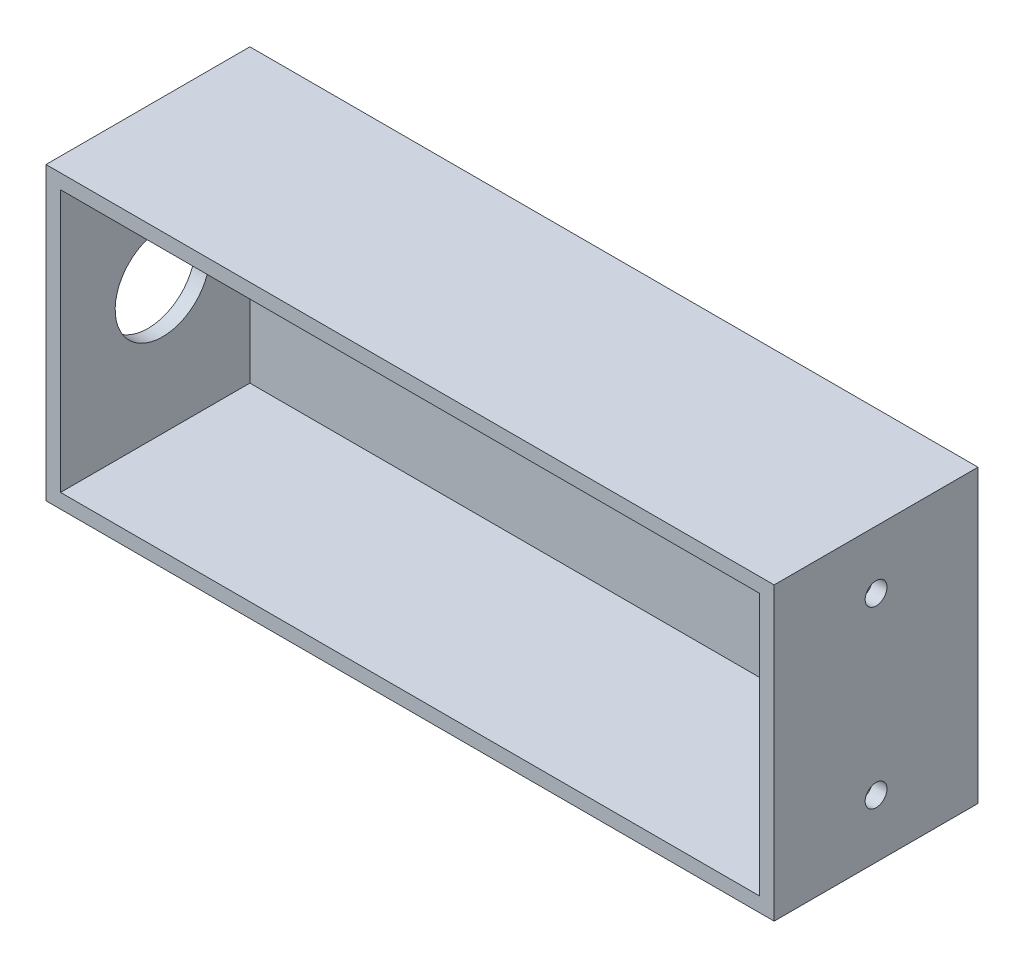
ISO-10303-21;
HEADER;
FILE_DESCRIPTION(('STEP AP214'),'2;1');
FILE_NAME('part.step','',(''),(''),'','','');
FILE_SCHEMA(('AUTOMOTIVE_DESIGN { 1 0 10303 214 1 1 1 1 }'));
ENDSEC;
DATA;
#1=APPLICATION_CONTEXT('core data for automotive mechanical design processes');
#2=APPLICATION_PROTOCOL_DEFINITION('international standard','automotive_design',2000,#1);
#3=PRODUCT_CONTEXT('',#1,'mechanical');
#4=PRODUCT('Part','Part','',(#3));
#5=PRODUCT_RELATED_PRODUCT_CATEGORY('part','',(#4));
#6=PRODUCT_DEFINITION_FORMATION('','',#4);
#7=PRODUCT_DEFINITION_CONTEXT('part definition',#1,'design');
#8=PRODUCT_DEFINITION('design','',#6,#7);
#9=PRODUCT_DEFINITION_SHAPE('','',#8);
#10=(LENGTH_UNIT() NAMED_UNIT(*) SI_UNIT(.MILLI.,.METRE.));
#11=(NAMED_UNIT(*) PLANE_ANGLE_UNIT() SI_UNIT($,.RADIAN.));
#12=(NAMED_UNIT(*) SI_UNIT($,.STERADIAN.) SOLID_ANGLE_UNIT());
#13=UNCERTAINTY_MEASURE_WITH_UNIT(LENGTH_MEASURE(1.E-05),#10,'distance_accuracy_value','');
#14=(GEOMETRIC_REPRESENTATION_CONTEXT(3) GLOBAL_UNCERTAINTY_ASSIGNED_CONTEXT((#13)) GLOBAL_UNIT_ASSIGNED_CONTEXT((#10,
#11,#12)) REPRESENTATION_CONTEXT('',''));
#15=CARTESIAN_POINT('',(0.,0.,0.));
#16=DIRECTION('',(0.,0.,1.));
#17=DIRECTION('',(1.,0.,0.));
#18=AXIS2_PLACEMENT_3D('',#15,#16,#17);
#19=CARTESIAN_POINT('',(100.,40.,56.));
#20=DIRECTION('',(-1.,0.,0.));
#21=DIRECTION('',(0.,-1.,0.));
#22=AXIS2_PLACEMENT_3D('',#19,#20,#21);
#23=PLANE('',#22);
#24=CARTESIAN_POINT('',(100.,-24.,28.));
#25=DIRECTION('',(1.,0.,0.));
#26=DIRECTION('',(0.,1.,0.));
#27=AXIS2_PLACEMENT_3D('',#24,#25,#26);
#28=CIRCLE('',#27,3.);
#29=CARTESIAN_POINT('',(100.,-21.,28.));
#30=VERTEX_POINT('',#29);
#31=EDGE_CURVE('E182',#30,#30,#28,.T.);
#32=ORIENTED_EDGE('',*,*,#31,.F.);
#33=EDGE_LOOP('',(#32));
#34=FACE_BOUND('',#33,.T.);
#35=CARTESIAN_POINT('',(100.,24.,28.));
#36=DIRECTION('',(1.,0.,0.));
#37=DIRECTION('',(0.,1.,0.));
#38=AXIS2_PLACEMENT_3D('',#35,#36,#37);
#39=CIRCLE('',#38,3.);
#40=CARTESIAN_POINT('',(100.,27.,28.));
#41=VERTEX_POINT('',#40);
#42=EDGE_CURVE('E173',#41,#41,#39,.T.);
#43=ORIENTED_EDGE('',*,*,#42,.F.);
#44=EDGE_LOOP('',(#43));
#45=FACE_BOUND('',#44,.T.);
#46=DIRECTION('',(0.,1.,0.));
#47=VECTOR('',#46,1.);
#48=CARTESIAN_POINT('',(100.,40.,0.));
#49=LINE('',#48,#47);
#50=CARTESIAN_POINT('',(100.,-40.,0.));
#51=VERTEX_POINT('',#50);
#52=CARTESIAN_POINT('',(100.,40.,0.));
#53=VERTEX_POINT('',#52);
#54=EDGE_CURVE('E148',#51,#53,#49,.T.);
#55=ORIENTED_EDGE('',*,*,#54,.T.);
#56=DIRECTION('',(0.,0.,-1.));
#57=VECTOR('',#56,1.);
#58=CARTESIAN_POINT('',(100.,40.,56.));
#59=LINE('',#58,#57);
#60=CARTESIAN_POINT('',(100.,40.,56.));
#61=VERTEX_POINT('',#60);
#62=EDGE_CURVE('E11',#61,#53,#59,.T.);
#63=ORIENTED_EDGE('',*,*,#62,.F.);
#64=DIRECTION('',(0.,1.,0.));
#65=VECTOR('',#64,1.);
#66=CARTESIAN_POINT('',(100.,40.,56.));
#67=LINE('',#66,#65);
#68=CARTESIAN_POINT('',(100.,-40.,56.));
#69=VERTEX_POINT('',#68);
#70=EDGE_CURVE('E152',#69,#61,#67,.T.);
#71=ORIENTED_EDGE('',*,*,#70,.F.);
#72=DIRECTION('',(0.,0.,-1.));
#73=VECTOR('',#72,1.);
#74=CARTESIAN_POINT('',(100.,-40.,56.));
#75=LINE('',#74,#73);
#76=EDGE_CURVE('E158',#69,#51,#75,.T.);
#77=ORIENTED_EDGE('',*,*,#76,.T.);
#78=EDGE_LOOP('',(#55,#63,#71,#77));
#79=FACE_BOUND('',#78,.T.);
#80=ADVANCED_FACE('F35',(#34,#45,#79),#23,.F.);
#81=CARTESIAN_POINT('',(-100.,40.,56.));
#82=DIRECTION('',(0.,-1.,0.));
#83=DIRECTION('',(0.,0.,-1.));
#84=AXIS2_PLACEMENT_3D('',#81,#82,#83);
#85=PLANE('',#84);
#86=DIRECTION('',(-1.,0.,0.));
#87=VECTOR('',#86,1.);
#88=CARTESIAN_POINT('',(-100.,40.,0.));
#89=LINE('',#88,#87);
#90=CARTESIAN_POINT('',(-100.,40.,0.));
#91=VERTEX_POINT('',#90);
#92=EDGE_CURVE('E161',#53,#91,#89,.T.);
#93=ORIENTED_EDGE('',*,*,#92,.T.);
#94=DIRECTION('',(0.,0.,-1.));
#95=VECTOR('',#94,1.);
#96=CARTESIAN_POINT('',(-100.,40.,56.));
#97=LINE('',#96,#95);
#98=CARTESIAN_POINT('',(-100.,40.,56.));
#99=VERTEX_POINT('',#98);
#100=EDGE_CURVE('E43',#99,#91,#97,.T.);
#101=ORIENTED_EDGE('',*,*,#100,.F.);
#102=DIRECTION('',(-1.,0.,0.));
#103=VECTOR('',#102,1.);
#104=CARTESIAN_POINT('',(-100.,40.,56.));
#105=LINE('',#104,#103);
#106=EDGE_CURVE('E88',#61,#99,#105,.T.);
#107=ORIENTED_EDGE('',*,*,#106,.F.);
#108=ORIENTED_EDGE('',*,*,#62,.T.);
#109=EDGE_LOOP('',(#93,#101,#107,#108));
#110=FACE_BOUND('',#109,.T.);
#111=ADVANCED_FACE('F192',(#110),#85,.F.);
#112=CARTESIAN_POINT('',(-100.,40.,56.));
#113=DIRECTION('',(1.,0.,0.));
#114=DIRECTION('',(0.,1.,0.));
#115=AXIS2_PLACEMENT_3D('',#112,#113,#114);
#116=PLANE('',#115);
#117=CARTESIAN_POINT('',(-100.,0.,28.));
#118=DIRECTION('',(-1.,0.,0.));
#119=DIRECTION('',(0.,-1.,0.));
#120=AXIS2_PLACEMENT_3D('',#117,#118,#119);
#121=CIRCLE('',#120,13.);
#122=CARTESIAN_POINT('',(-100.,-13.,28.));
#123=VERTEX_POINT('',#122);
#124=EDGE_CURVE('E172',#123,#123,#121,.T.);
#125=ORIENTED_EDGE('',*,*,#124,.F.);
#126=EDGE_LOOP('',(#125));
#127=FACE_BOUND('',#126,.T.);
#128=DIRECTION('',(0.,-1.,0.));
#129=VECTOR('',#128,1.);
#130=CARTESIAN_POINT('',(-100.,40.,0.));
#131=LINE('',#130,#129);
#132=CARTESIAN_POINT('',(-99.9999999999999,-40.,0.));
#133=VERTEX_POINT('',#132);
#134=EDGE_CURVE('E163',#91,#133,#131,.T.);
#135=ORIENTED_EDGE('',*,*,#134,.T.);
#136=DIRECTION('',(0.,0.,-1.));
#137=VECTOR('',#136,1.);
#138=CARTESIAN_POINT('',(-99.9999999999999,-40.,56.));
#139=LINE('',#138,#137);
#140=CARTESIAN_POINT('',(-99.9999999999999,-40.,56.));
#141=VERTEX_POINT('',#140);
#142=EDGE_CURVE('E167',#141,#133,#139,.T.);
#143=ORIENTED_EDGE('',*,*,#142,.F.);
#144=DIRECTION('',(0.,-1.,0.));
#145=VECTOR('',#144,1.);
#146=CARTESIAN_POINT('',(-100.,40.,56.));
#147=LINE('',#146,#145);
#148=EDGE_CURVE('E155',#99,#141,#147,.T.);
#149=ORIENTED_EDGE('',*,*,#148,.F.);
#150=ORIENTED_EDGE('',*,*,#100,.T.);
#151=EDGE_LOOP('',(#135,#143,#149,#150));
#152=FACE_BOUND('',#151,.T.);
#153=ADVANCED_FACE('F201',(#127,#152),#116,.F.);
#154=CARTESIAN_POINT('',(-99.9999999999999,-40.,56.));
#155=DIRECTION('',(0.,1.,0.));
#156=DIRECTION('',(0.,0.,1.));
#157=AXIS2_PLACEMENT_3D('',#154,#155,#156);
#158=PLANE('',#157);
#159=DIRECTION('',(1.,0.,0.));
#160=VECTOR('',#159,1.);
#161=CARTESIAN_POINT('',(-99.9999999999999,-40.,0.));
#162=LINE('',#161,#160);
#163=EDGE_CURVE('E81',#133,#51,#162,.T.);
#164=ORIENTED_EDGE('',*,*,#163,.T.);
#165=ORIENTED_EDGE('',*,*,#76,.F.);
#166=DIRECTION('',(1.,0.,0.));
#167=VECTOR('',#166,1.);
#168=CARTESIAN_POINT('',(-99.9999999999999,-40.,56.));
#169=LINE('',#168,#167);
#170=EDGE_CURVE('E60',#141,#69,#169,.T.);
#171=ORIENTED_EDGE('',*,*,#170,.F.);
#172=ORIENTED_EDGE('',*,*,#142,.T.);
#173=EDGE_LOOP('',(#164,#165,#171,#172));
#174=FACE_BOUND('',#173,.T.);
#175=ADVANCED_FACE('F207',(#174),#158,.F.);
#176=CARTESIAN_POINT('',(0.,0.,56.));
#177=DIRECTION('',(0.,0.,1.));
#178=DIRECTION('',(1.,0.,0.));
#179=AXIS2_PLACEMENT_3D('',#176,#177,#178);
#180=PLANE('',#179);
#181=DIRECTION('',(0.,1.,0.));
#182=VECTOR('',#181,1.);
#183=CARTESIAN_POINT('',(96.,36.,56.));
#184=LINE('',#183,#182);
#185=CARTESIAN_POINT('',(96.,-36.,56.));
#186=VERTEX_POINT('',#185);
#187=CARTESIAN_POINT('',(96.,36.,56.));
#188=VERTEX_POINT('',#187);
#189=EDGE_CURVE('E51',#186,#188,#184,.T.);
#190=ORIENTED_EDGE('',*,*,#189,.F.);
#191=DIRECTION('',(1.,0.,0.));
#192=VECTOR('',#191,1.);
#193=CARTESIAN_POINT('',(-96.,-36.,56.));
#194=LINE('',#193,#192);
#195=CARTESIAN_POINT('',(-96.,-36.,56.));
#196=VERTEX_POINT('',#195);
#197=EDGE_CURVE('E130',#196,#186,#194,.T.);
#198=ORIENTED_EDGE('',*,*,#197,.F.);
#199=DIRECTION('',(0.,-1.,0.));
#200=VECTOR('',#199,1.);
#201=CARTESIAN_POINT('',(-96.,36.,56.));
#202=LINE('',#201,#200);
#203=CARTESIAN_POINT('',(-96.,36.,56.));
#204=VERTEX_POINT('',#203);
#205=EDGE_CURVE('E133',#204,#196,#202,.T.);
#206=ORIENTED_EDGE('',*,*,#205,.F.);
#207=DIRECTION('',(-1.,0.,0.));
#208=VECTOR('',#207,1.);
#209=CARTESIAN_POINT('',(-96.,36.,56.));
#210=LINE('',#209,#208);
#211=EDGE_CURVE('E142',#188,#204,#210,.T.);
#212=ORIENTED_EDGE('',*,*,#211,.F.);
#213=EDGE_LOOP('',(#190,#198,#206,#212));
#214=FACE_BOUND('',#213,.T.);
#215=ORIENTED_EDGE('',*,*,#70,.T.);
#216=ORIENTED_EDGE('',*,*,#106,.T.);
#217=ORIENTED_EDGE('',*,*,#148,.T.);
#218=ORIENTED_EDGE('',*,*,#170,.T.);
#219=EDGE_LOOP('',(#215,#216,#217,#218));
#220=FACE_BOUND('',#219,.T.);
#221=ADVANCED_FACE('F213',(#214,#220),#180,.T.);
#222=CARTESIAN_POINT('',(0.,0.,0.));
#223=DIRECTION('',(0.,0.,1.));
#224=DIRECTION('',(1.,0.,0.));
#225=AXIS2_PLACEMENT_3D('',#222,#223,#224);
#226=PLANE('',#225);
#227=ORIENTED_EDGE('',*,*,#54,.F.);
#228=ORIENTED_EDGE('',*,*,#163,.F.);
#229=ORIENTED_EDGE('',*,*,#134,.F.);
#230=ORIENTED_EDGE('',*,*,#92,.F.);
#231=EDGE_LOOP('',(#227,#228,#229,#230));
#232=FACE_BOUND('',#231,.T.);
#233=ADVANCED_FACE('F198',(#232),#226,.F.);
#234=CARTESIAN_POINT('',(96.,36.,4.));
#235=DIRECTION('',(1.,0.,0.));
#236=DIRECTION('',(0.,1.,0.));
#237=AXIS2_PLACEMENT_3D('',#234,#235,#236);
#238=PLANE('',#237);
#239=CARTESIAN_POINT('',(96.,-24.,28.));
#240=DIRECTION('',(1.,0.,0.));
#241=DIRECTION('',(0.,1.,0.));
#242=AXIS2_PLACEMENT_3D('',#239,#240,#241);
#243=CIRCLE('',#242,3.);
#244=CARTESIAN_POINT('',(96.,-21.,28.));
#245=VERTEX_POINT('',#244);
#246=EDGE_CURVE('E38',#245,#245,#243,.T.);
#247=ORIENTED_EDGE('',*,*,#246,.T.);
#248=EDGE_LOOP('',(#247));
#249=FACE_BOUND('',#248,.T.);
#250=CARTESIAN_POINT('',(96.,24.,28.));
#251=DIRECTION('',(1.,0.,0.));
#252=DIRECTION('',(0.,1.,0.));
#253=AXIS2_PLACEMENT_3D('',#250,#251,#252);
#254=CIRCLE('',#253,3.);
#255=CARTESIAN_POINT('',(96.,27.,28.));
#256=VERTEX_POINT('',#255);
#257=EDGE_CURVE('E170',#256,#256,#254,.T.);
#258=ORIENTED_EDGE('',*,*,#257,.T.);
#259=EDGE_LOOP('',(#258));
#260=FACE_BOUND('',#259,.T.);
#261=ORIENTED_EDGE('',*,*,#189,.T.);
#262=DIRECTION('',(0.,0.,1.));
#263=VECTOR('',#262,1.);
#264=CARTESIAN_POINT('',(96.,36.,4.));
#265=LINE('',#264,#263);
#266=CARTESIAN_POINT('',(96.,36.,4.));
#267=VERTEX_POINT('',#266);
#268=EDGE_CURVE('E108',#267,#188,#265,.T.);
#269=ORIENTED_EDGE('',*,*,#268,.F.);
#270=DIRECTION('',(0.,1.,0.));
#271=VECTOR('',#270,1.);
#272=CARTESIAN_POINT('',(96.,36.,4.));
#273=LINE('',#272,#271);
#274=CARTESIAN_POINT('',(96.,-36.,4.));
#275=VERTEX_POINT('',#274);
#276=EDGE_CURVE('E112',#275,#267,#273,.T.);
#277=ORIENTED_EDGE('',*,*,#276,.F.);
#278=DIRECTION('',(0.,0.,1.));
#279=VECTOR('',#278,1.);
#280=CARTESIAN_POINT('',(96.,-36.,4.));
#281=LINE('',#280,#279);
#282=EDGE_CURVE('E146',#275,#186,#281,.T.);
#283=ORIENTED_EDGE('',*,*,#282,.T.);
#284=EDGE_LOOP('',(#261,#269,#277,#283));
#285=FACE_BOUND('',#284,.T.);
#286=ADVANCED_FACE('F110',(#249,#260,#285),#238,.F.);
#287=CARTESIAN_POINT('',(-96.,-36.,4.));
#288=DIRECTION('',(0.,-1.,0.));
#289=DIRECTION('',(0.,0.,-1.));
#290=AXIS2_PLACEMENT_3D('',#287,#288,#289);
#291=PLANE('',#290);
#292=ORIENTED_EDGE('',*,*,#197,.T.);
#293=ORIENTED_EDGE('',*,*,#282,.F.);
#294=DIRECTION('',(1.,0.,0.));
#295=VECTOR('',#294,1.);
#296=CARTESIAN_POINT('',(-96.,-36.,4.));
#297=LINE('',#296,#295);
#298=CARTESIAN_POINT('',(-96.,-36.,4.));
#299=VERTEX_POINT('',#298);
#300=EDGE_CURVE('E118',#299,#275,#297,.T.);
#301=ORIENTED_EDGE('',*,*,#300,.F.);
#302=DIRECTION('',(0.,0.,1.));
#303=VECTOR('',#302,1.);
#304=CARTESIAN_POINT('',(-96.,-36.,4.));
#305=LINE('',#304,#303);
#306=EDGE_CURVE('E149',#299,#196,#305,.T.);
#307=ORIENTED_EDGE('',*,*,#306,.T.);
#308=EDGE_LOOP('',(#292,#293,#301,#307));
#309=FACE_BOUND('',#308,.T.);
#310=ADVANCED_FACE('F221',(#309),#291,.F.);
#311=CARTESIAN_POINT('',(-96.,36.,4.));
#312=DIRECTION('',(-1.,0.,0.));
#313=DIRECTION('',(0.,-1.,0.));
#314=AXIS2_PLACEMENT_3D('',#311,#312,#313);
#315=PLANE('',#314);
#316=CARTESIAN_POINT('',(-96.,0.,28.));
#317=DIRECTION('',(-1.,0.,0.));
#318=DIRECTION('',(0.,-1.,0.));
#319=AXIS2_PLACEMENT_3D('',#316,#317,#318);
#320=CIRCLE('',#319,13.);
#321=CARTESIAN_POINT('',(-96.,-13.,28.));
#322=VERTEX_POINT('',#321);
#323=EDGE_CURVE('E136',#322,#322,#320,.F.);
#324=ORIENTED_EDGE('',*,*,#323,.F.);
#325=EDGE_LOOP('',(#324));
#326=FACE_BOUND('',#325,.T.);
#327=ORIENTED_EDGE('',*,*,#205,.T.);
#328=ORIENTED_EDGE('',*,*,#306,.F.);
#329=DIRECTION('',(0.,-1.,0.));
#330=VECTOR('',#329,1.);
#331=CARTESIAN_POINT('',(-96.,36.,4.));
#332=LINE('',#331,#330);
#333=CARTESIAN_POINT('',(-96.,36.,4.));
#334=VERTEX_POINT('',#333);
#335=EDGE_CURVE('E126',#334,#299,#332,.T.);
#336=ORIENTED_EDGE('',*,*,#335,.F.);
#337=DIRECTION('',(0.,0.,1.));
#338=VECTOR('',#337,1.);
#339=CARTESIAN_POINT('',(-96.,36.,4.));
#340=LINE('',#339,#338);
#341=EDGE_CURVE('E117',#334,#204,#340,.T.);
#342=ORIENTED_EDGE('',*,*,#341,.T.);
#343=EDGE_LOOP('',(#327,#328,#336,#342));
#344=FACE_BOUND('',#343,.T.);
#345=ADVANCED_FACE('F225',(#326,#344),#315,.F.);
#346=CARTESIAN_POINT('',(-96.,36.,4.));
#347=DIRECTION('',(0.,1.,0.));
#348=DIRECTION('',(0.,0.,1.));
#349=AXIS2_PLACEMENT_3D('',#346,#347,#348);
#350=PLANE('',#349);
#351=ORIENTED_EDGE('',*,*,#211,.T.);
#352=ORIENTED_EDGE('',*,*,#341,.F.);
#353=DIRECTION('',(-1.,0.,0.));
#354=VECTOR('',#353,1.);
#355=CARTESIAN_POINT('',(-96.,36.,4.));
#356=LINE('',#355,#354);
#357=EDGE_CURVE('E121',#267,#334,#356,.T.);
#358=ORIENTED_EDGE('',*,*,#357,.F.);
#359=ORIENTED_EDGE('',*,*,#268,.T.);
#360=EDGE_LOOP('',(#351,#352,#358,#359));
#361=FACE_BOUND('',#360,.T.);
#362=ADVANCED_FACE('F122',(#361),#350,.F.);
#363=CARTESIAN_POINT('',(0.,0.,4.));
#364=DIRECTION('',(0.,0.,1.));
#365=DIRECTION('',(1.,0.,0.));
#366=AXIS2_PLACEMENT_3D('',#363,#364,#365);
#367=PLANE('',#366);
#368=ORIENTED_EDGE('',*,*,#276,.T.);
#369=ORIENTED_EDGE('',*,*,#357,.T.);
#370=ORIENTED_EDGE('',*,*,#335,.T.);
#371=ORIENTED_EDGE('',*,*,#300,.T.);
#372=EDGE_LOOP('',(#368,#369,#370,#371));
#373=FACE_BOUND('',#372,.T.);
#374=ADVANCED_FACE('F128',(#373),#367,.T.);
#375=CARTESIAN_POINT('',(-59.2304473782995,0.,28.));
#376=DIRECTION('',(-1.,0.,0.));
#377=DIRECTION('',(0.,-1.,0.));
#378=AXIS2_PLACEMENT_3D('',#375,#376,#377);
#379=CYLINDRICAL_SURFACE('',#378,13.);
#380=ORIENTED_EDGE('',*,*,#323,.T.);
#381=EDGE_LOOP('',(#380));
#382=FACE_BOUND('',#381,.T.);
#383=ORIENTED_EDGE('',*,*,#124,.T.);
#384=EDGE_LOOP('',(#383));
#385=FACE_BOUND('',#384,.T.);
#386=ADVANCED_FACE('F234',(#382,#385),#379,.F.);
#387=CARTESIAN_POINT('',(90.,24.,28.));
#388=DIRECTION('',(1.,0.,0.));
#389=DIRECTION('',(0.,1.,0.));
#390=AXIS2_PLACEMENT_3D('',#387,#388,#389);
#391=CYLINDRICAL_SURFACE('',#390,3.);
#392=ORIENTED_EDGE('',*,*,#42,.T.);
#393=EDGE_LOOP('',(#392));
#394=FACE_BOUND('',#393,.T.);
#395=ORIENTED_EDGE('',*,*,#257,.F.);
#396=EDGE_LOOP('',(#395));
#397=FACE_BOUND('',#396,.T.);
#398=ADVANCED_FACE('F237',(#394,#397),#391,.F.);
#399=CARTESIAN_POINT('',(90.,-24.,28.));
#400=DIRECTION('',(1.,0.,0.));
#401=DIRECTION('',(0.,1.,0.));
#402=AXIS2_PLACEMENT_3D('',#399,#400,#401);
#403=CYLINDRICAL_SURFACE('',#402,3.);
#404=ORIENTED_EDGE('',*,*,#31,.T.);
#405=EDGE_LOOP('',(#404));
#406=FACE_BOUND('',#405,.T.);
#407=ORIENTED_EDGE('',*,*,#246,.F.);
#408=EDGE_LOOP('',(#407));
#409=FACE_BOUND('',#408,.T.);
#410=ADVANCED_FACE('F187',(#406,#409),#403,.F.);
#411=CLOSED_SHELL('',(#80,#111,#153,#175,#221,#233,#286,#310,#345,#362,#374,#386,#398,#410));
#412=MANIFOLD_SOLID_BREP('B2',#411);
#413=ADVANCED_BREP_SHAPE_REPRESENTATION('',(#18,#412),#14);
#414=SHAPE_DEFINITION_REPRESENTATION(#9,#413);
ENDSEC;
END-ISO-10303-21;
